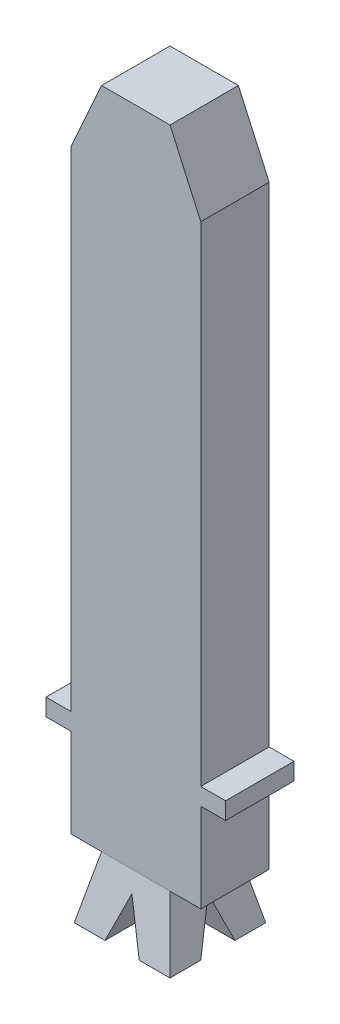
ISO-10303-21;
HEADER;
FILE_DESCRIPTION(('STEP AP214'),'2;1');
FILE_NAME('part.step','',(''),(''),'','','');
FILE_SCHEMA(('AUTOMOTIVE_DESIGN { 1 0 10303 214 1 1 1 1 }'));
ENDSEC;
DATA;
#1=APPLICATION_CONTEXT('core data for automotive mechanical design processes');
#2=APPLICATION_PROTOCOL_DEFINITION('international standard','automotive_design',2000,#1);
#3=PRODUCT_CONTEXT('',#1,'mechanical');
#4=PRODUCT('Part','Part','',(#3));
#5=PRODUCT_RELATED_PRODUCT_CATEGORY('part','',(#4));
#6=PRODUCT_DEFINITION_FORMATION('','',#4);
#7=PRODUCT_DEFINITION_CONTEXT('part definition',#1,'design');
#8=PRODUCT_DEFINITION('design','',#6,#7);
#9=PRODUCT_DEFINITION_SHAPE('','',#8);
#10=(LENGTH_UNIT() NAMED_UNIT(*) SI_UNIT(.MILLI.,.METRE.));
#11=(NAMED_UNIT(*) PLANE_ANGLE_UNIT() SI_UNIT($,.RADIAN.));
#12=(NAMED_UNIT(*) SI_UNIT($,.STERADIAN.) SOLID_ANGLE_UNIT());
#13=UNCERTAINTY_MEASURE_WITH_UNIT(LENGTH_MEASURE(1.E-05),#10,'distance_accuracy_value','');
#14=(GEOMETRIC_REPRESENTATION_CONTEXT(3) GLOBAL_UNCERTAINTY_ASSIGNED_CONTEXT((#13)) GLOBAL_UNIT_ASSIGNED_CONTEXT((#10,
#11,#12)) REPRESENTATION_CONTEXT('',''));
#15=CARTESIAN_POINT('',(0.,0.,0.));
#16=DIRECTION('',(0.,0.,1.));
#17=DIRECTION('',(1.,0.,0.));
#18=AXIS2_PLACEMENT_3D('',#15,#16,#17);
#19=CARTESIAN_POINT('',(0.,-4.9,0.));
#20=DIRECTION('',(0.,-1.,0.));
#21=DIRECTION('',(0.,0.,-1.));
#22=AXIS2_PLACEMENT_3D('',#19,#20,#21);
#23=PLANE('',#22);
#24=DIRECTION('',(-1.,0.,0.));
#25=VECTOR('',#24,1.);
#26=CARTESIAN_POINT('',(2.625,-4.9,1.5));
#27=LINE('',#26,#25);
#28=CARTESIAN_POINT('',(1.4,-4.9,1.5));
#29=VERTEX_POINT('',#28);
#30=CARTESIAN_POINT('',(0.5,-4.9,1.5));
#31=VERTEX_POINT('',#30);
#32=EDGE_CURVE('E478',#29,#31,#27,.T.);
#33=ORIENTED_EDGE('',*,*,#32,.F.);
#34=DIRECTION('',(0.,0.,1.));
#35=VECTOR('',#34,1.);
#36=CARTESIAN_POINT('',(1.4,-4.9,-0.4));
#37=LINE('',#36,#35);
#38=CARTESIAN_POINT('',(1.4,-4.9,2.4));
#39=VERTEX_POINT('',#38);
#40=EDGE_CURVE('E180',#29,#39,#37,.T.);
#41=ORIENTED_EDGE('',*,*,#40,.T.);
#42=DIRECTION('',(-1.,0.,0.));
#43=VECTOR('',#42,1.);
#44=CARTESIAN_POINT('',(1.4,-4.9,2.4));
#45=LINE('',#44,#43);
#46=CARTESIAN_POINT('',(0.500000000000001,-4.9,2.4));
#47=VERTEX_POINT('',#46);
#48=EDGE_CURVE('E355',#39,#47,#45,.T.);
#49=ORIENTED_EDGE('',*,*,#48,.T.);
#50=DIRECTION('',(0.,0.,1.));
#51=VECTOR('',#50,1.);
#52=CARTESIAN_POINT('',(0.500000000000001,-4.9,-0.4001));
#53=LINE('',#52,#51);
#54=EDGE_CURVE('E326',#31,#47,#53,.T.);
#55=ORIENTED_EDGE('',*,*,#54,.F.);
#56=EDGE_LOOP('',(#33,#41,#49,#55));
#57=FACE_BOUND('',#56,.T.);
#58=ADVANCED_FACE('F52',(#57),#23,.T.);
#59=CARTESIAN_POINT('',(-0.499999999999999,-4.9,1.5));
#60=VERTEX_POINT('',#59);
#61=CARTESIAN_POINT('',(-1.4,-4.9,1.5));
#62=VERTEX_POINT('',#61);
#63=EDGE_CURVE('E159',#60,#62,#27,.T.);
#64=ORIENTED_EDGE('',*,*,#63,.F.);
#65=DIRECTION('',(0.,0.,1.));
#66=VECTOR('',#65,1.);
#67=CARTESIAN_POINT('',(-0.499999999999999,-4.9,-0.4001));
#68=LINE('',#67,#66);
#69=CARTESIAN_POINT('',(-0.499999999999999,-4.9,2.4));
#70=VERTEX_POINT('',#69);
#71=EDGE_CURVE('E359',#60,#70,#68,.T.);
#72=ORIENTED_EDGE('',*,*,#71,.T.);
#73=CARTESIAN_POINT('',(-1.4,-4.9,2.4));
#74=VERTEX_POINT('',#73);
#75=EDGE_CURVE('E179',#70,#74,#45,.T.);
#76=ORIENTED_EDGE('',*,*,#75,.T.);
#77=DIRECTION('',(0.,0.,-1.));
#78=VECTOR('',#77,1.);
#79=CARTESIAN_POINT('',(-1.4,-4.9,-0.4));
#80=LINE('',#79,#78);
#81=EDGE_CURVE('E389',#74,#62,#80,.T.);
#82=ORIENTED_EDGE('',*,*,#81,.T.);
#83=EDGE_LOOP('',(#64,#72,#76,#82));
#84=FACE_BOUND('',#83,.T.);
#85=ADVANCED_FACE('F518',(#84),#23,.T.);
#86=CARTESIAN_POINT('',(0.500000000000001,-4.9,-0.4001));
#87=DIRECTION('',(0.932267960991806,0.361768501818747,0.));
#88=DIRECTION('',(-0.361768501818747,0.932267960991806,0.));
#89=AXIS2_PLACEMENT_3D('',#86,#87,#88);
#90=PLANE('',#89);
#91=DIRECTION('',(0.,0.,1.));
#92=VECTOR('',#91,1.);
#93=CARTESIAN_POINT('',(0.,-3.61151308598601,-0.4001));
#94=LINE('',#93,#92);
#95=CARTESIAN_POINT('',(0.,-3.611513085986,0.999999999999999));
#96=VERTEX_POINT('',#95);
#97=CARTESIAN_POINT('',(0.,-3.611513085986,2.11366957466356));
#98=VERTEX_POINT('',#97);
#99=EDGE_CURVE('E472',#96,#98,#94,.T.);
#100=ORIENTED_EDGE('',*,*,#99,.F.);
#101=DIRECTION('',(0.340191275432694,-0.876664013313512,0.340191275432694));
#102=VECTOR('',#101,1.);
#103=CARTESIAN_POINT('',(0.280101229616619,-4.33332662390649,1.28010122961662));
#104=LINE('',#103,#102);
#105=EDGE_CURVE('E171',#96,#31,#104,.T.);
#106=ORIENTED_EDGE('',*,*,#105,.T.);
#107=ORIENTED_EDGE('',*,*,#54,.T.);
#108=DIRECTION('',(0.354246297399246,-0.912883437073675,0.202862986016372));
#109=VECTOR('',#108,1.);
#110=CARTESIAN_POINT('',(-1.3198068575803,-0.210405355949719,1.35786785687772));
#111=LINE('',#110,#109);
#112=EDGE_CURVE('E319',#98,#47,#111,.T.);
#113=ORIENTED_EDGE('',*,*,#112,.F.);
#114=EDGE_LOOP('',(#100,#106,#107,#113));
#115=FACE_BOUND('',#114,.T.);
#116=ADVANCED_FACE('F475',(#115),#90,.F.);
#117=CARTESIAN_POINT('',(0.,-3.61151308598601,-0.4001));
#118=DIRECTION('',(-0.932267960991806,0.361768501818746,0.));
#119=DIRECTION('',(-0.361768501818746,-0.932267960991806,0.));
#120=AXIS2_PLACEMENT_3D('',#117,#118,#119);
#121=PLANE('',#120);
#122=ORIENTED_EDGE('',*,*,#71,.F.);
#123=DIRECTION('',(0.340191275432693,0.876664013313513,-0.340191275432694));
#124=VECTOR('',#123,1.);
#125=CARTESIAN_POINT('',(0.16203371844312,-3.19395643430003,0.837966281556879));
#126=LINE('',#125,#124);
#127=EDGE_CURVE('E13',#60,#96,#126,.T.);
#128=ORIENTED_EDGE('',*,*,#127,.T.);
#129=ORIENTED_EDGE('',*,*,#99,.T.);
#130=DIRECTION('',(0.354246297399245,0.912883437073675,-0.202862986016372));
#131=VECTOR('',#130,1.);
#132=CARTESIAN_POINT('',(1.3198068575803,-0.210405355949717,1.35786785687771));
#133=LINE('',#132,#131);
#134=EDGE_CURVE('E322',#70,#98,#133,.T.);
#135=ORIENTED_EDGE('',*,*,#134,.F.);
#136=EDGE_LOOP('',(#122,#128,#129,#135));
#137=FACE_BOUND('',#136,.T.);
#138=ADVANCED_FACE('F470',(#137),#121,.F.);
#139=DIRECTION('',(-1.,0.,0.));
#140=VECTOR('',#139,1.);
#141=CARTESIAN_POINT('',(2.625,-4.9,0.499999999999999));
#142=LINE('',#141,#140);
#143=CARTESIAN_POINT('',(1.4,-4.9,0.499999999999999));
#144=VERTEX_POINT('',#143);
#145=CARTESIAN_POINT('',(0.5,-4.9,0.499999999999999));
#146=VERTEX_POINT('',#145);
#147=EDGE_CURVE('E148',#144,#146,#142,.T.);
#148=ORIENTED_EDGE('',*,*,#147,.T.);
#149=CARTESIAN_POINT('',(0.500000000000001,-4.9,-0.4));
#150=VERTEX_POINT('',#149);
#151=EDGE_CURVE('E323',#150,#146,#53,.T.);
#152=ORIENTED_EDGE('',*,*,#151,.F.);
#153=DIRECTION('',(1.,0.,0.));
#154=VECTOR('',#153,1.);
#155=CARTESIAN_POINT('',(1.4,-4.9,-0.4));
#156=LINE('',#155,#154);
#157=CARTESIAN_POINT('',(1.4,-4.9,-0.4));
#158=VERTEX_POINT('',#157);
#159=EDGE_CURVE('E177',#150,#158,#156,.T.);
#160=ORIENTED_EDGE('',*,*,#159,.T.);
#161=EDGE_CURVE('E167',#158,#144,#37,.T.);
#162=ORIENTED_EDGE('',*,*,#161,.T.);
#163=EDGE_LOOP('',(#148,#152,#160,#162));
#164=FACE_BOUND('',#163,.T.);
#165=ADVANCED_FACE('F175',(#164),#23,.T.);
#166=CARTESIAN_POINT('',(-0.499999999999999,-4.9,0.499999999999999));
#167=VERTEX_POINT('',#166);
#168=CARTESIAN_POINT('',(-1.4,-4.9,0.499999999999999));
#169=VERTEX_POINT('',#168);
#170=EDGE_CURVE('E71',#167,#169,#142,.T.);
#171=ORIENTED_EDGE('',*,*,#170,.T.);
#172=CARTESIAN_POINT('',(-1.4,-4.9,-0.4));
#173=VERTEX_POINT('',#172);
#174=EDGE_CURVE('E57',#169,#173,#80,.T.);
#175=ORIENTED_EDGE('',*,*,#174,.T.);
#176=CARTESIAN_POINT('',(-0.499999999999999,-4.9,-0.4));
#177=VERTEX_POINT('',#176);
#178=EDGE_CURVE('E249',#173,#177,#156,.T.);
#179=ORIENTED_EDGE('',*,*,#178,.T.);
#180=EDGE_CURVE('E78',#177,#167,#68,.T.);
#181=ORIENTED_EDGE('',*,*,#180,.T.);
#182=EDGE_LOOP('',(#171,#175,#179,#181));
#183=FACE_BOUND('',#182,.T.);
#184=ADVANCED_FACE('F54',(#183),#23,.T.);
#185=CARTESIAN_POINT('',(0.,-3.1,0.));
#186=DIRECTION('',(0.,-1.,0.));
#187=DIRECTION('',(0.,0.,-1.));
#188=AXIS2_PLACEMENT_3D('',#185,#186,#187);
#189=PLANE('',#188);
#190=DIRECTION('',(0.,0.,-1.));
#191=VECTOR('',#190,1.);
#192=CARTESIAN_POINT('',(-1.,-3.1,2.));
#193=LINE('',#192,#191);
#194=CARTESIAN_POINT('',(-1.,-3.1,2.));
#195=VERTEX_POINT('',#194);
#196=CARTESIAN_POINT('',(-1.,-3.1,0.));
#197=VERTEX_POINT('',#196);
#198=EDGE_CURVE('E297',#195,#197,#193,.T.);
#199=ORIENTED_EDGE('',*,*,#198,.F.);
#200=DIRECTION('',(-1.,0.,0.));
#201=VECTOR('',#200,1.);
#202=CARTESIAN_POINT('',(-1.,-3.1,2.));
#203=LINE('',#202,#201);
#204=CARTESIAN_POINT('',(1.,-3.1,2.));
#205=VERTEX_POINT('',#204);
#206=EDGE_CURVE('E302',#205,#195,#203,.T.);
#207=ORIENTED_EDGE('',*,*,#206,.F.);
#208=DIRECTION('',(0.,0.,1.));
#209=VECTOR('',#208,1.);
#210=CARTESIAN_POINT('',(1.,-3.1,2.));
#211=LINE('',#210,#209);
#212=CARTESIAN_POINT('',(1.,-3.1,0.));
#213=VERTEX_POINT('',#212);
#214=EDGE_CURVE('E405',#213,#205,#211,.T.);
#215=ORIENTED_EDGE('',*,*,#214,.F.);
#216=DIRECTION('',(1.,0.,0.));
#217=VECTOR('',#216,1.);
#218=CARTESIAN_POINT('',(-1.,-3.1,0.));
#219=LINE('',#218,#217);
#220=EDGE_CURVE('E437',#197,#213,#219,.T.);
#221=ORIENTED_EDGE('',*,*,#220,.F.);
#222=EDGE_LOOP('',(#199,#207,#215,#221));
#223=FACE_BOUND('',#222,.T.);
#224=ADVANCED_FACE('F415',(#223),#189,.F.);
#225=CARTESIAN_POINT('',(0.,0.277647058823529,1.24941176470588));
#226=DIRECTION('',(0.,-0.216930457818656,-0.976187060183953));
#227=DIRECTION('',(0.,0.976187060183953,-0.216930457818656));
#228=AXIS2_PLACEMENT_3D('',#225,#226,#227);
#229=PLANE('',#228);
#230=ORIENTED_EDGE('',*,*,#134,.T.);
#231=ORIENTED_EDGE('',*,*,#112,.T.);
#232=ORIENTED_EDGE('',*,*,#48,.F.);
#233=DIRECTION('',(0.211999576001272,-0.953998092005724,0.211999576001272));
#234=VECTOR('',#233,1.);
#235=CARTESIAN_POINT('',(1.,-3.1,2.));
#236=LINE('',#235,#234);
#237=EDGE_CURVE('E279',#205,#39,#236,.T.);
#238=ORIENTED_EDGE('',*,*,#237,.F.);
#239=ORIENTED_EDGE('',*,*,#206,.T.);
#240=DIRECTION('',(-0.211999576001272,-0.953998092005724,0.211999576001272));
#241=VECTOR('',#240,1.);
#242=CARTESIAN_POINT('',(-1.,-3.1,2.));
#243=LINE('',#242,#241);
#244=EDGE_CURVE('E283',#195,#74,#243,.T.);
#245=ORIENTED_EDGE('',*,*,#244,.T.);
#246=ORIENTED_EDGE('',*,*,#75,.F.);
#247=EDGE_LOOP('',(#230,#231,#232,#238,#239,#245,#246));
#248=FACE_BOUND('',#247,.T.);
#249=ADVANCED_FACE('F228',(#248),#229,.F.);
#250=CARTESIAN_POINT('',(0.296470588235295,0.0658823529411766,0.));
#251=DIRECTION('',(-0.976187060183953,-0.216930457818656,0.));
#252=DIRECTION('',(0.216930457818656,-0.976187060183953,0.));
#253=AXIS2_PLACEMENT_3D('',#250,#251,#252);
#254=PLANE('',#253);
#255=ORIENTED_EDGE('',*,*,#40,.F.);
#256=DIRECTION('',(-0.202862986016372,0.912883437073675,-0.354246297399246));
#257=VECTOR('',#256,1.);
#258=CARTESIAN_POINT('',(0.32715778629754,-0.0722100383389264,-0.373433835125718));
#259=LINE('',#258,#257);
#260=CARTESIAN_POINT('',(1.11366957466356,-3.611513085986,0.999999999999998));
#261=VERTEX_POINT('',#260);
#262=EDGE_CURVE('E170',#29,#261,#259,.T.);
#263=ORIENTED_EDGE('',*,*,#262,.T.);
#264=DIRECTION('',(0.202862986016372,-0.912883437073675,-0.354246297399245));
#265=VECTOR('',#264,1.);
#266=CARTESIAN_POINT('',(0.470884709648849,-0.718981193419817,2.12245295668356));
#267=LINE('',#266,#265);
#268=EDGE_CURVE('E151',#261,#144,#267,.T.);
#269=ORIENTED_EDGE('',*,*,#268,.T.);
#270=ORIENTED_EDGE('',*,*,#161,.F.);
#271=DIRECTION('',(0.211999576001272,-0.953998092005724,-0.211999576001272));
#272=VECTOR('',#271,1.);
#273=CARTESIAN_POINT('',(1.,-3.1,0.));
#274=LINE('',#273,#272);
#275=EDGE_CURVE('E270',#213,#158,#274,.T.);
#276=ORIENTED_EDGE('',*,*,#275,.F.);
#277=ORIENTED_EDGE('',*,*,#214,.T.);
#278=ORIENTED_EDGE('',*,*,#237,.T.);
#279=EDGE_LOOP('',(#255,#263,#269,#270,#276,#277,#278));
#280=FACE_BOUND('',#279,.T.);
#281=ADVANCED_FACE('F165',(#280),#254,.F.);
#282=CARTESIAN_POINT('',(-0.296470588235294,0.0658823529411765,0.));
#283=DIRECTION('',(0.976187060183953,-0.216930457818656,0.));
#284=DIRECTION('',(0.216930457818656,0.976187060183953,0.));
#285=AXIS2_PLACEMENT_3D('',#282,#283,#284);
#286=PLANE('',#285);
#287=DIRECTION('',(0.202862986016372,0.912883437073675,0.354246297399245));
#288=VECTOR('',#287,1.);
#289=CARTESIAN_POINT('',(-0.470884709648848,-0.718981193419817,2.12245295668357));
#290=LINE('',#289,#288);
#291=CARTESIAN_POINT('',(-1.11366957466356,-3.611513085986,0.999999999999999));
#292=VERTEX_POINT('',#291);
#293=EDGE_CURVE('E172',#169,#292,#290,.T.);
#294=ORIENTED_EDGE('',*,*,#293,.T.);
#295=DIRECTION('',(-0.202862986016372,-0.912883437073675,0.354246297399246));
#296=VECTOR('',#295,1.);
#297=CARTESIAN_POINT('',(-0.327157786297539,-0.0722100383389265,-0.373433835125718));
#298=LINE('',#297,#296);
#299=EDGE_CURVE('E500',#292,#62,#298,.T.);
#300=ORIENTED_EDGE('',*,*,#299,.T.);
#301=ORIENTED_EDGE('',*,*,#81,.F.);
#302=ORIENTED_EDGE('',*,*,#244,.F.);
#303=ORIENTED_EDGE('',*,*,#198,.T.);
#304=DIRECTION('',(-0.211999576001272,-0.953998092005724,-0.211999576001272));
#305=VECTOR('',#304,1.);
#306=CARTESIAN_POINT('',(-1.,-3.1,0.));
#307=LINE('',#306,#305);
#308=EDGE_CURVE('E276',#197,#173,#307,.T.);
#309=ORIENTED_EDGE('',*,*,#308,.T.);
#310=ORIENTED_EDGE('',*,*,#174,.F.);
#311=EDGE_LOOP('',(#294,#300,#301,#302,#303,#309,#310));
#312=FACE_BOUND('',#311,.T.);
#313=ADVANCED_FACE('F227',(#312),#286,.F.);
#314=CARTESIAN_POINT('',(0.,-0.145882352941177,0.656470588235294));
#315=DIRECTION('',(0.,-0.216930457818656,0.976187060183953));
#316=DIRECTION('',(0.,-0.976187060183953,-0.216930457818656));
#317=AXIS2_PLACEMENT_3D('',#314,#315,#316);
#318=PLANE('',#317);
#319=ORIENTED_EDGE('',*,*,#159,.F.);
#320=DIRECTION('',(-0.354246297399246,0.912883437073675,0.202862986016372));
#321=VECTOR('',#320,1.);
#322=CARTESIAN_POINT('',(-1.17607993422899,-0.580785875809028,0.559825360931327));
#323=LINE('',#322,#321);
#324=CARTESIAN_POINT('',(0.,-3.611513085986,-0.113669574663557));
#325=VERTEX_POINT('',#324);
#326=EDGE_CURVE('E361',#150,#325,#323,.T.);
#327=ORIENTED_EDGE('',*,*,#326,.T.);
#328=DIRECTION('',(-0.354246297399245,-0.912883437073675,-0.202862986016372));
#329=VECTOR('',#328,1.);
#330=CARTESIAN_POINT('',(1.17607993422899,-0.580785875809026,0.559825360931328));
#331=LINE('',#330,#329);
#332=EDGE_CURVE('E364',#325,#177,#331,.T.);
#333=ORIENTED_EDGE('',*,*,#332,.T.);
#334=ORIENTED_EDGE('',*,*,#178,.F.);
#335=ORIENTED_EDGE('',*,*,#308,.F.);
#336=ORIENTED_EDGE('',*,*,#220,.T.);
#337=ORIENTED_EDGE('',*,*,#275,.T.);
#338=EDGE_LOOP('',(#319,#327,#333,#334,#335,#336,#337));
#339=FACE_BOUND('',#338,.T.);
#340=ADVANCED_FACE('F253',(#339),#318,.F.);
#341=ORIENTED_EDGE('',*,*,#151,.T.);
#342=DIRECTION('',(-0.340191275432694,0.876664013313513,0.340191275432693));
#343=VECTOR('',#342,1.);
#344=CARTESIAN_POINT('',(0.604168666502859,-5.16843992727844,0.395831333497141));
#345=LINE('',#344,#343);
#346=EDGE_CURVE('E154',#146,#96,#345,.T.);
#347=ORIENTED_EDGE('',*,*,#346,.T.);
#348=EDGE_CURVE('E360',#325,#96,#94,.T.);
#349=ORIENTED_EDGE('',*,*,#348,.F.);
#350=ORIENTED_EDGE('',*,*,#326,.F.);
#351=EDGE_LOOP('',(#341,#347,#349,#350));
#352=FACE_BOUND('',#351,.T.);
#353=ADVANCED_FACE('F261',(#352),#90,.F.);
#354=ORIENTED_EDGE('',*,*,#348,.T.);
#355=DIRECTION('',(-0.340191275432693,-0.876664013313513,-0.340191275432693));
#356=VECTOR('',#355,1.);
#357=CARTESIAN_POINT('',(-0.16203371844312,-4.02906973767198,0.837966281556879));
#358=LINE('',#357,#356);
#359=EDGE_CURVE('E63',#96,#167,#358,.T.);
#360=ORIENTED_EDGE('',*,*,#359,.T.);
#361=ORIENTED_EDGE('',*,*,#180,.F.);
#362=ORIENTED_EDGE('',*,*,#332,.F.);
#363=EDGE_LOOP('',(#354,#360,#361,#362));
#364=FACE_BOUND('',#363,.T.);
#365=ADVANCED_FACE('F529',(#364),#121,.F.);
#366=CARTESIAN_POINT('',(2.625,-3.611513085986,0.999999999999999));
#367=DIRECTION('',(0.,0.361768501818746,-0.932267960991806));
#368=DIRECTION('',(0.,0.932267960991806,0.361768501818746));
#369=AXIS2_PLACEMENT_3D('',#366,#367,#368);
#370=PLANE('',#369);
#371=ORIENTED_EDGE('',*,*,#170,.F.);
#372=ORIENTED_EDGE('',*,*,#359,.F.);
#373=DIRECTION('',(-1.,0.,0.));
#374=VECTOR('',#373,1.);
#375=CARTESIAN_POINT('',(2.625,-3.611513085986,0.999999999999999));
#376=LINE('',#375,#374);
#377=EDGE_CURVE('E492',#96,#292,#376,.T.);
#378=ORIENTED_EDGE('',*,*,#377,.T.);
#379=ORIENTED_EDGE('',*,*,#293,.F.);
#380=EDGE_LOOP('',(#371,#372,#378,#379));
#381=FACE_BOUND('',#380,.T.);
#382=ADVANCED_FACE('F502',(#381),#370,.F.);
#383=CARTESIAN_POINT('',(2.625,-4.9,1.5));
#384=DIRECTION('',(0.,0.361768501818747,0.932267960991806));
#385=DIRECTION('',(0.,-0.932267960991806,0.361768501818747));
#386=AXIS2_PLACEMENT_3D('',#383,#384,#385);
#387=PLANE('',#386);
#388=ORIENTED_EDGE('',*,*,#377,.F.);
#389=ORIENTED_EDGE('',*,*,#127,.F.);
#390=ORIENTED_EDGE('',*,*,#63,.T.);
#391=ORIENTED_EDGE('',*,*,#299,.F.);
#392=EDGE_LOOP('',(#388,#389,#390,#391));
#393=FACE_BOUND('',#392,.T.);
#394=ADVANCED_FACE('F510',(#393),#387,.F.);
#395=ORIENTED_EDGE('',*,*,#32,.T.);
#396=ORIENTED_EDGE('',*,*,#105,.F.);
#397=EDGE_CURVE('E495',#261,#96,#376,.T.);
#398=ORIENTED_EDGE('',*,*,#397,.F.);
#399=ORIENTED_EDGE('',*,*,#262,.F.);
#400=EDGE_LOOP('',(#395,#396,#398,#399));
#401=FACE_BOUND('',#400,.T.);
#402=ADVANCED_FACE('F505',(#401),#387,.F.);
#403=ORIENTED_EDGE('',*,*,#397,.T.);
#404=ORIENTED_EDGE('',*,*,#346,.F.);
#405=ORIENTED_EDGE('',*,*,#147,.F.);
#406=ORIENTED_EDGE('',*,*,#268,.F.);
#407=EDGE_LOOP('',(#403,#404,#405,#406));
#408=FACE_BOUND('',#407,.T.);
#409=ADVANCED_FACE('F150',(#408),#370,.F.);
#410=CLOSED_SHELL('',(#58,#85,#116,#138,#165,#184,#224,#249,#281,#313,#340,#353,#365,#382,#394,
#402,#409));
#411=MANIFOLD_SOLID_BREP('B2',#410);
#412=CARTESIAN_POINT('',(-1.9,14.3,2.));
#413=DIRECTION('',(0.911921505175107,-0.410364677328798,0.));
#414=DIRECTION('',(0.410364677328798,0.911921505175107,0.));
#415=AXIS2_PLACEMENT_3D('',#412,#413,#414);
#416=PLANE('',#415);
#417=DIRECTION('',(-0.410364677328797,-0.911921505175106,0.));
#418=VECTOR('',#417,1.);
#419=CARTESIAN_POINT('',(-1.9,14.3,0.));
#420=LINE('',#419,#418);
#421=CARTESIAN_POINT('',(-1.,16.3,0.));
#422=VERTEX_POINT('',#421);
#423=CARTESIAN_POINT('',(-1.9,14.3,0.));
#424=VERTEX_POINT('',#423);
#425=EDGE_CURVE('E802',#422,#424,#420,.T.);
#426=ORIENTED_EDGE('',*,*,#425,.T.);
#427=DIRECTION('',(0.,0.,-1.));
#428=VECTOR('',#427,1.);
#429=CARTESIAN_POINT('',(-1.9,14.3,2.));
#430=LINE('',#429,#428);
#431=CARTESIAN_POINT('',(-1.9,14.3,2.));
#432=VERTEX_POINT('',#431);
#433=EDGE_CURVE('E50',#432,#424,#430,.T.);
#434=ORIENTED_EDGE('',*,*,#433,.F.);
#435=DIRECTION('',(-0.410364677328797,-0.911921505175106,0.));
#436=VECTOR('',#435,1.);
#437=CARTESIAN_POINT('',(-1.9,14.3,2.));
#438=LINE('',#437,#436);
#439=CARTESIAN_POINT('',(-1.,16.3,2.));
#440=VERTEX_POINT('',#439);
#441=EDGE_CURVE('E828',#440,#432,#438,.T.);
#442=ORIENTED_EDGE('',*,*,#441,.F.);
#443=DIRECTION('',(0.,0.,-1.));
#444=VECTOR('',#443,1.);
#445=CARTESIAN_POINT('',(-1.,16.3,2.));
#446=LINE('',#445,#444);
#447=EDGE_CURVE('E798',#440,#422,#446,.T.);
#448=ORIENTED_EDGE('',*,*,#447,.T.);
#449=EDGE_LOOP('',(#426,#434,#442,#448));
#450=FACE_BOUND('',#449,.T.);
#451=ADVANCED_FACE('F670',(#450),#416,.F.);
#452=CARTESIAN_POINT('',(-1.9,14.3,2.));
#453=DIRECTION('',(1.,0.,0.));
#454=DIRECTION('',(0.,1.,0.));
#455=AXIS2_PLACEMENT_3D('',#452,#453,#454);
#456=PLANE('',#455);
#457=DIRECTION('',(0.,-1.,0.));
#458=VECTOR('',#457,1.);
#459=CARTESIAN_POINT('',(-1.9,14.3,0.));
#460=LINE('',#459,#458);
#461=CARTESIAN_POINT('',(-1.9,0.,0.));
#462=VERTEX_POINT('',#461);
#463=EDGE_CURVE('E805',#424,#462,#460,.T.);
#464=ORIENTED_EDGE('',*,*,#463,.T.);
#465=DIRECTION('',(0.,0.,-1.));
#466=VECTOR('',#465,1.);
#467=CARTESIAN_POINT('',(-1.9,0.,2.));
#468=LINE('',#467,#466);
#469=CARTESIAN_POINT('',(-1.9,0.,2.));
#470=VERTEX_POINT('',#469);
#471=EDGE_CURVE('E678',#470,#462,#468,.T.);
#472=ORIENTED_EDGE('',*,*,#471,.F.);
#473=DIRECTION('',(0.,-1.,0.));
#474=VECTOR('',#473,1.);
#475=CARTESIAN_POINT('',(-1.9,14.3,2.));
#476=LINE('',#475,#474);
#477=EDGE_CURVE('E747',#432,#470,#476,.T.);
#478=ORIENTED_EDGE('',*,*,#477,.F.);
#479=ORIENTED_EDGE('',*,*,#433,.T.);
#480=EDGE_LOOP('',(#464,#472,#478,#479));
#481=FACE_BOUND('',#480,.T.);
#482=ADVANCED_FACE('F916',(#481),#456,.F.);
#483=CARTESIAN_POINT('',(-2.625,0.,2.));
#484=DIRECTION('',(0.,-1.,0.));
#485=DIRECTION('',(1.,0.,0.));
#486=AXIS2_PLACEMENT_3D('',#483,#484,#485);
#487=PLANE('',#486);
#488=DIRECTION('',(-1.,0.,0.));
#489=VECTOR('',#488,1.);
#490=CARTESIAN_POINT('',(-2.625,0.,0.));
#491=LINE('',#490,#489);
#492=CARTESIAN_POINT('',(-2.625,0.,0.));
#493=VERTEX_POINT('',#492);
#494=EDGE_CURVE('E807',#462,#493,#491,.T.);
#495=ORIENTED_EDGE('',*,*,#494,.T.);
#496=DIRECTION('',(0.,0.,-1.));
#497=VECTOR('',#496,1.);
#498=CARTESIAN_POINT('',(-2.625,0.,2.));
#499=LINE('',#498,#497);
#500=CARTESIAN_POINT('',(-2.625,0.,2.));
#501=VERTEX_POINT('',#500);
#502=EDGE_CURVE('E853',#501,#493,#499,.T.);
#503=ORIENTED_EDGE('',*,*,#502,.F.);
#504=DIRECTION('',(-1.,0.,0.));
#505=VECTOR('',#504,1.);
#506=CARTESIAN_POINT('',(-2.625,0.,2.));
#507=LINE('',#506,#505);
#508=EDGE_CURVE('E861',#470,#501,#507,.T.);
#509=ORIENTED_EDGE('',*,*,#508,.F.);
#510=ORIENTED_EDGE('',*,*,#471,.T.);
#511=EDGE_LOOP('',(#495,#503,#509,#510));
#512=FACE_BOUND('',#511,.T.);
#513=ADVANCED_FACE('F859',(#512),#487,.F.);
#514=CARTESIAN_POINT('',(-2.625,0.,2.));
#515=DIRECTION('',(1.,0.,0.));
#516=DIRECTION('',(0.,0.,-1.));
#517=AXIS2_PLACEMENT_3D('',#514,#515,#516);
#518=PLANE('',#517);
#519=DIRECTION('',(0.,-1.,0.));
#520=VECTOR('',#519,1.);
#521=CARTESIAN_POINT('',(-2.625,0.,0.));
#522=LINE('',#521,#520);
#523=CARTESIAN_POINT('',(-2.625,-0.5,0.));
#524=VERTEX_POINT('',#523);
#525=EDGE_CURVE('E809',#493,#524,#522,.T.);
#526=ORIENTED_EDGE('',*,*,#525,.T.);
#527=DIRECTION('',(0.,0.,-1.));
#528=VECTOR('',#527,1.);
#529=CARTESIAN_POINT('',(-2.625,-0.5,2.));
#530=LINE('',#529,#528);
#531=CARTESIAN_POINT('',(-2.625,-0.5,2.));
#532=VERTEX_POINT('',#531);
#533=EDGE_CURVE('E850',#532,#524,#530,.T.);
#534=ORIENTED_EDGE('',*,*,#533,.F.);
#535=DIRECTION('',(0.,-1.,0.));
#536=VECTOR('',#535,1.);
#537=CARTESIAN_POINT('',(-2.625,0.,2.));
#538=LINE('',#537,#536);
#539=EDGE_CURVE('E879',#501,#532,#538,.T.);
#540=ORIENTED_EDGE('',*,*,#539,.F.);
#541=ORIENTED_EDGE('',*,*,#502,.T.);
#542=EDGE_LOOP('',(#526,#534,#540,#541));
#543=FACE_BOUND('',#542,.T.);
#544=ADVANCED_FACE('F870',(#543),#518,.F.);
#545=CARTESIAN_POINT('',(-2.625,-0.5,2.));
#546=DIRECTION('',(0.,1.,0.));
#547=DIRECTION('',(0.,0.,1.));
#548=AXIS2_PLACEMENT_3D('',#545,#546,#547);
#549=PLANE('',#548);
#550=DIRECTION('',(1.,0.,0.));
#551=VECTOR('',#550,1.);
#552=CARTESIAN_POINT('',(-2.625,-0.5,0.));
#553=LINE('',#552,#551);
#554=CARTESIAN_POINT('',(-1.9,-0.5,0.));
#555=VERTEX_POINT('',#554);
#556=EDGE_CURVE('E811',#524,#555,#553,.T.);
#557=ORIENTED_EDGE('',*,*,#556,.T.);
#558=DIRECTION('',(0.,0.,-1.));
#559=VECTOR('',#558,1.);
#560=CARTESIAN_POINT('',(-1.9,-0.5,2.));
#561=LINE('',#560,#559);
#562=CARTESIAN_POINT('',(-1.9,-0.5,2.));
#563=VERTEX_POINT('',#562);
#564=EDGE_CURVE('E847',#563,#555,#561,.T.);
#565=ORIENTED_EDGE('',*,*,#564,.F.);
#566=DIRECTION('',(1.,0.,0.));
#567=VECTOR('',#566,1.);
#568=CARTESIAN_POINT('',(-2.625,-0.5,2.));
#569=LINE('',#568,#567);
#570=EDGE_CURVE('E876',#532,#563,#569,.T.);
#571=ORIENTED_EDGE('',*,*,#570,.F.);
#572=ORIENTED_EDGE('',*,*,#533,.T.);
#573=EDGE_LOOP('',(#557,#565,#571,#572));
#574=FACE_BOUND('',#573,.T.);
#575=ADVANCED_FACE('F874',(#574),#549,.F.);
#576=CARTESIAN_POINT('',(-1.9,-0.5,2.));
#577=DIRECTION('',(1.,0.,0.));
#578=DIRECTION('',(0.,1.,0.));
#579=AXIS2_PLACEMENT_3D('',#576,#577,#578);
#580=PLANE('',#579);
#581=DIRECTION('',(0.,-1.,0.));
#582=VECTOR('',#581,1.);
#583=CARTESIAN_POINT('',(-1.9,-0.5,0.));
#584=LINE('',#583,#582);
#585=CARTESIAN_POINT('',(-1.9,-3.1,0.));
#586=VERTEX_POINT('',#585);
#587=EDGE_CURVE('E813',#555,#586,#584,.T.);
#588=ORIENTED_EDGE('',*,*,#587,.T.);
#589=DIRECTION('',(0.,0.,-1.));
#590=VECTOR('',#589,1.);
#591=CARTESIAN_POINT('',(-1.9,-3.1,2.));
#592=LINE('',#591,#590);
#593=CARTESIAN_POINT('',(-1.9,-3.1,2.));
#594=VERTEX_POINT('',#593);
#595=EDGE_CURVE('E844',#594,#586,#592,.T.);
#596=ORIENTED_EDGE('',*,*,#595,.F.);
#597=DIRECTION('',(0.,-1.,0.));
#598=VECTOR('',#597,1.);
#599=CARTESIAN_POINT('',(-1.9,-0.5,2.));
#600=LINE('',#599,#598);
#601=EDGE_CURVE('E878',#563,#594,#600,.T.);
#602=ORIENTED_EDGE('',*,*,#601,.F.);
#603=ORIENTED_EDGE('',*,*,#564,.T.);
#604=EDGE_LOOP('',(#588,#596,#602,#603));
#605=FACE_BOUND('',#604,.T.);
#606=ADVANCED_FACE('F929',(#605),#580,.F.);
#607=CARTESIAN_POINT('',(-1.9,-3.1,2.));
#608=DIRECTION('',(0.,1.,0.));
#609=DIRECTION('',(0.,0.,1.));
#610=AXIS2_PLACEMENT_3D('',#607,#608,#609);
#611=PLANE('',#610);
#612=DIRECTION('',(1.,0.,0.));
#613=VECTOR('',#612,1.);
#614=CARTESIAN_POINT('',(-1.9,-3.1,0.));
#615=LINE('',#614,#613);
#616=CARTESIAN_POINT('',(1.9,-3.1,0.));
#617=VERTEX_POINT('',#616);
#618=EDGE_CURVE('E815',#586,#617,#615,.T.);
#619=ORIENTED_EDGE('',*,*,#618,.T.);
#620=DIRECTION('',(0.,0.,-1.));
#621=VECTOR('',#620,1.);
#622=CARTESIAN_POINT('',(1.9,-3.1,2.));
#623=LINE('',#622,#621);
#624=CARTESIAN_POINT('',(1.9,-3.1,2.));
#625=VERTEX_POINT('',#624);
#626=EDGE_CURVE('E841',#625,#617,#623,.T.);
#627=ORIENTED_EDGE('',*,*,#626,.F.);
#628=DIRECTION('',(1.,0.,0.));
#629=VECTOR('',#628,1.);
#630=CARTESIAN_POINT('',(-1.9,-3.1,2.));
#631=LINE('',#630,#629);
#632=EDGE_CURVE('E881',#594,#625,#631,.T.);
#633=ORIENTED_EDGE('',*,*,#632,.F.);
#634=ORIENTED_EDGE('',*,*,#595,.T.);
#635=EDGE_LOOP('',(#619,#627,#633,#634));
#636=FACE_BOUND('',#635,.T.);
#637=ADVANCED_FACE('F932',(#636),#611,.F.);
#638=CARTESIAN_POINT('',(1.9,-0.5,2.));
#639=DIRECTION('',(-1.,0.,0.));
#640=DIRECTION('',(0.,-1.,0.));
#641=AXIS2_PLACEMENT_3D('',#638,#639,#640);
#642=PLANE('',#641);
#643=DIRECTION('',(0.,1.,0.));
#644=VECTOR('',#643,1.);
#645=CARTESIAN_POINT('',(1.9,-0.5,0.));
#646=LINE('',#645,#644);
#647=CARTESIAN_POINT('',(1.9,-0.5,0.));
#648=VERTEX_POINT('',#647);
#649=EDGE_CURVE('E817',#617,#648,#646,.T.);
#650=ORIENTED_EDGE('',*,*,#649,.T.);
#651=DIRECTION('',(0.,0.,-1.));
#652=VECTOR('',#651,1.);
#653=CARTESIAN_POINT('',(1.9,-0.5,2.));
#654=LINE('',#653,#652);
#655=CARTESIAN_POINT('',(1.9,-0.5,2.));
#656=VERTEX_POINT('',#655);
#657=EDGE_CURVE('E838',#656,#648,#654,.T.);
#658=ORIENTED_EDGE('',*,*,#657,.F.);
#659=DIRECTION('',(0.,1.,0.));
#660=VECTOR('',#659,1.);
#661=CARTESIAN_POINT('',(1.9,-0.5,2.));
#662=LINE('',#661,#660);
#663=EDGE_CURVE('E887',#625,#656,#662,.T.);
#664=ORIENTED_EDGE('',*,*,#663,.F.);
#665=ORIENTED_EDGE('',*,*,#626,.T.);
#666=EDGE_LOOP('',(#650,#658,#664,#665));
#667=FACE_BOUND('',#666,.T.);
#668=ADVANCED_FACE('F936',(#667),#642,.F.);
#669=CARTESIAN_POINT('',(1.9,-0.5,2.));
#670=DIRECTION('',(0.,1.,0.));
#671=DIRECTION('',(0.,0.,1.));
#672=AXIS2_PLACEMENT_3D('',#669,#670,#671);
#673=PLANE('',#672);
#674=DIRECTION('',(1.,0.,0.));
#675=VECTOR('',#674,1.);
#676=CARTESIAN_POINT('',(1.9,-0.5,0.));
#677=LINE('',#676,#675);
#678=CARTESIAN_POINT('',(2.625,-0.5,0.));
#679=VERTEX_POINT('',#678);
#680=EDGE_CURVE('E819',#648,#679,#677,.T.);
#681=ORIENTED_EDGE('',*,*,#680,.T.);
#682=DIRECTION('',(0.,0.,-1.));
#683=VECTOR('',#682,1.);
#684=CARTESIAN_POINT('',(2.625,-0.5,2.));
#685=LINE('',#684,#683);
#686=CARTESIAN_POINT('',(2.625,-0.5,2.));
#687=VERTEX_POINT('',#686);
#688=EDGE_CURVE('E835',#687,#679,#685,.T.);
#689=ORIENTED_EDGE('',*,*,#688,.F.);
#690=DIRECTION('',(1.,0.,0.));
#691=VECTOR('',#690,1.);
#692=CARTESIAN_POINT('',(1.9,-0.5,2.));
#693=LINE('',#692,#691);
#694=EDGE_CURVE('E889',#656,#687,#693,.T.);
#695=ORIENTED_EDGE('',*,*,#694,.F.);
#696=ORIENTED_EDGE('',*,*,#657,.T.);
#697=EDGE_LOOP('',(#681,#689,#695,#696));
#698=FACE_BOUND('',#697,.T.);
#699=ADVANCED_FACE('F940',(#698),#673,.F.);
#700=CARTESIAN_POINT('',(2.625,0.,2.));
#701=DIRECTION('',(-1.,0.,0.));
#702=DIRECTION('',(0.,0.,1.));
#703=AXIS2_PLACEMENT_3D('',#700,#701,#702);
#704=PLANE('',#703);
#705=DIRECTION('',(0.,1.,0.));
#706=VECTOR('',#705,1.);
#707=CARTESIAN_POINT('',(2.625,0.,0.));
#708=LINE('',#707,#706);
#709=CARTESIAN_POINT('',(2.625,0.,0.));
#710=VERTEX_POINT('',#709);
#711=EDGE_CURVE('E821',#679,#710,#708,.T.);
#712=ORIENTED_EDGE('',*,*,#711,.T.);
#713=DIRECTION('',(0.,0.,-1.));
#714=VECTOR('',#713,1.);
#715=CARTESIAN_POINT('',(2.625,0.,2.));
#716=LINE('',#715,#714);
#717=CARTESIAN_POINT('',(2.625,0.,2.));
#718=VERTEX_POINT('',#717);
#719=EDGE_CURVE('E832',#718,#710,#716,.T.);
#720=ORIENTED_EDGE('',*,*,#719,.F.);
#721=DIRECTION('',(0.,1.,0.));
#722=VECTOR('',#721,1.);
#723=CARTESIAN_POINT('',(2.625,0.,2.));
#724=LINE('',#723,#722);
#725=EDGE_CURVE('E891',#687,#718,#724,.T.);
#726=ORIENTED_EDGE('',*,*,#725,.F.);
#727=ORIENTED_EDGE('',*,*,#688,.T.);
#728=EDGE_LOOP('',(#712,#720,#726,#727));
#729=FACE_BOUND('',#728,.T.);
#730=ADVANCED_FACE('F897',(#729),#704,.F.);
#731=CARTESIAN_POINT('',(1.9,0.,2.));
#732=DIRECTION('',(0.,-1.,0.));
#733=DIRECTION('',(1.,0.,0.));
#734=AXIS2_PLACEMENT_3D('',#731,#732,#733);
#735=PLANE('',#734);
#736=DIRECTION('',(-1.,0.,0.));
#737=VECTOR('',#736,1.);
#738=CARTESIAN_POINT('',(1.9,0.,0.));
#739=LINE('',#738,#737);
#740=CARTESIAN_POINT('',(1.9,0.,0.));
#741=VERTEX_POINT('',#740);
#742=EDGE_CURVE('E823',#710,#741,#739,.T.);
#743=ORIENTED_EDGE('',*,*,#742,.T.);
#744=DIRECTION('',(0.,0.,-1.));
#745=VECTOR('',#744,1.);
#746=CARTESIAN_POINT('',(1.9,0.,2.));
#747=LINE('',#746,#745);
#748=CARTESIAN_POINT('',(1.9,0.,2.));
#749=VERTEX_POINT('',#748);
#750=EDGE_CURVE('E793',#749,#741,#747,.T.);
#751=ORIENTED_EDGE('',*,*,#750,.F.);
#752=DIRECTION('',(-1.,0.,0.));
#753=VECTOR('',#752,1.);
#754=CARTESIAN_POINT('',(1.9,0.,2.));
#755=LINE('',#754,#753);
#756=EDGE_CURVE('E784',#718,#749,#755,.T.);
#757=ORIENTED_EDGE('',*,*,#756,.F.);
#758=ORIENTED_EDGE('',*,*,#719,.T.);
#759=EDGE_LOOP('',(#743,#751,#757,#758));
#760=FACE_BOUND('',#759,.T.);
#761=ADVANCED_FACE('F901',(#760),#735,.F.);
#762=CARTESIAN_POINT('',(1.9,14.3,2.));
#763=DIRECTION('',(-1.,0.,0.));
#764=DIRECTION('',(0.,-1.,0.));
#765=AXIS2_PLACEMENT_3D('',#762,#763,#764);
#766=PLANE('',#765);
#767=DIRECTION('',(0.,1.,0.));
#768=VECTOR('',#767,1.);
#769=CARTESIAN_POINT('',(1.9,14.3,0.));
#770=LINE('',#769,#768);
#771=CARTESIAN_POINT('',(1.9,14.3,0.));
#772=VERTEX_POINT('',#771);
#773=EDGE_CURVE('E792',#741,#772,#770,.T.);
#774=ORIENTED_EDGE('',*,*,#773,.T.);
#775=DIRECTION('',(0.,0.,-1.));
#776=VECTOR('',#775,1.);
#777=CARTESIAN_POINT('',(1.9,14.3,2.));
#778=LINE('',#777,#776);
#779=CARTESIAN_POINT('',(1.9,14.3,2.));
#780=VERTEX_POINT('',#779);
#781=EDGE_CURVE('E789',#780,#772,#778,.T.);
#782=ORIENTED_EDGE('',*,*,#781,.F.);
#783=DIRECTION('',(0.,1.,0.));
#784=VECTOR('',#783,1.);
#785=CARTESIAN_POINT('',(1.9,14.3,2.));
#786=LINE('',#785,#784);
#787=EDGE_CURVE('E778',#749,#780,#786,.T.);
#788=ORIENTED_EDGE('',*,*,#787,.F.);
#789=ORIENTED_EDGE('',*,*,#750,.T.);
#790=EDGE_LOOP('',(#774,#782,#788,#789));
#791=FACE_BOUND('',#790,.T.);
#792=ADVANCED_FACE('F790',(#791),#766,.F.);
#793=CARTESIAN_POINT('',(0.999999999999998,16.3,2.));
#794=DIRECTION('',(-0.911921505175107,-0.410364677328798,0.));
#795=DIRECTION('',(0.410364677328798,-0.911921505175107,0.));
#796=AXIS2_PLACEMENT_3D('',#793,#794,#795);
#797=PLANE('',#796);
#798=DIRECTION('',(-0.410364677328797,0.911921505175106,0.));
#799=VECTOR('',#798,1.);
#800=CARTESIAN_POINT('',(0.999999999999998,16.3,0.));
#801=LINE('',#800,#799);
#802=CARTESIAN_POINT('',(0.999999999999998,16.3,0.));
#803=VERTEX_POINT('',#802);
#804=EDGE_CURVE('E733',#772,#803,#801,.T.);
#805=ORIENTED_EDGE('',*,*,#804,.T.);
#806=DIRECTION('',(0.,0.,-1.));
#807=VECTOR('',#806,1.);
#808=CARTESIAN_POINT('',(0.999999999999998,16.3,2.));
#809=LINE('',#808,#807);
#810=CARTESIAN_POINT('',(0.999999999999998,16.3,2.));
#811=VERTEX_POINT('',#810);
#812=EDGE_CURVE('E794',#811,#803,#809,.T.);
#813=ORIENTED_EDGE('',*,*,#812,.F.);
#814=DIRECTION('',(-0.410364677328797,0.911921505175106,0.));
#815=VECTOR('',#814,1.);
#816=CARTESIAN_POINT('',(0.999999999999998,16.3,2.));
#817=LINE('',#816,#815);
#818=EDGE_CURVE('E782',#780,#811,#817,.T.);
#819=ORIENTED_EDGE('',*,*,#818,.F.);
#820=ORIENTED_EDGE('',*,*,#781,.T.);
#821=EDGE_LOOP('',(#805,#813,#819,#820));
#822=FACE_BOUND('',#821,.T.);
#823=ADVANCED_FACE('F796',(#822),#797,.F.);
#824=CARTESIAN_POINT('',(-1.,16.3,2.));
#825=DIRECTION('',(0.,-1.,0.));
#826=DIRECTION('',(0.,0.,-1.));
#827=AXIS2_PLACEMENT_3D('',#824,#825,#826);
#828=PLANE('',#827);
#829=DIRECTION('',(-1.,0.,0.));
#830=VECTOR('',#829,1.);
#831=CARTESIAN_POINT('',(-1.,16.3,0.));
#832=LINE('',#831,#830);
#833=EDGE_CURVE('E739',#803,#422,#832,.T.);
#834=ORIENTED_EDGE('',*,*,#833,.T.);
#835=ORIENTED_EDGE('',*,*,#447,.F.);
#836=DIRECTION('',(-1.,0.,0.));
#837=VECTOR('',#836,1.);
#838=CARTESIAN_POINT('',(-1.,16.3,2.));
#839=LINE('',#838,#837);
#840=EDGE_CURVE('E686',#811,#440,#839,.T.);
#841=ORIENTED_EDGE('',*,*,#840,.F.);
#842=ORIENTED_EDGE('',*,*,#812,.T.);
#843=EDGE_LOOP('',(#834,#835,#841,#842));
#844=FACE_BOUND('',#843,.T.);
#845=ADVANCED_FACE('F905',(#844),#828,.F.);
#846=CARTESIAN_POINT('',(0.,0.,2.));
#847=DIRECTION('',(0.,0.,-1.));
#848=DIRECTION('',(-1.,0.,0.));
#849=AXIS2_PLACEMENT_3D('',#846,#847,#848);
#850=PLANE('',#849);
#851=ORIENTED_EDGE('',*,*,#441,.T.);
#852=ORIENTED_EDGE('',*,*,#477,.T.);
#853=ORIENTED_EDGE('',*,*,#508,.T.);
#854=ORIENTED_EDGE('',*,*,#539,.T.);
#855=ORIENTED_EDGE('',*,*,#570,.T.);
#856=ORIENTED_EDGE('',*,*,#601,.T.);
#857=ORIENTED_EDGE('',*,*,#632,.T.);
#858=ORIENTED_EDGE('',*,*,#663,.T.);
#859=ORIENTED_EDGE('',*,*,#694,.T.);
#860=ORIENTED_EDGE('',*,*,#725,.T.);
#861=ORIENTED_EDGE('',*,*,#756,.T.);
#862=ORIENTED_EDGE('',*,*,#787,.T.);
#863=ORIENTED_EDGE('',*,*,#818,.T.);
#864=ORIENTED_EDGE('',*,*,#840,.T.);
#865=EDGE_LOOP('',(#851,#852,#853,#854,#855,#856,#857,#858,#859,#860,#861,#862,#863,#864));
#866=FACE_BOUND('',#865,.T.);
#867=ADVANCED_FACE('F780',(#866),#850,.F.);
#868=CARTESIAN_POINT('',(0.,0.,0.));
#869=DIRECTION('',(0.,0.,-1.));
#870=DIRECTION('',(-1.,0.,0.));
#871=AXIS2_PLACEMENT_3D('',#868,#869,#870);
#872=PLANE('',#871);
#873=ORIENTED_EDGE('',*,*,#425,.F.);
#874=ORIENTED_EDGE('',*,*,#833,.F.);
#875=ORIENTED_EDGE('',*,*,#804,.F.);
#876=ORIENTED_EDGE('',*,*,#773,.F.);
#877=ORIENTED_EDGE('',*,*,#742,.F.);
#878=ORIENTED_EDGE('',*,*,#711,.F.);
#879=ORIENTED_EDGE('',*,*,#680,.F.);
#880=ORIENTED_EDGE('',*,*,#649,.F.);
#881=ORIENTED_EDGE('',*,*,#618,.F.);
#882=ORIENTED_EDGE('',*,*,#587,.F.);
#883=ORIENTED_EDGE('',*,*,#556,.F.);
#884=ORIENTED_EDGE('',*,*,#525,.F.);
#885=ORIENTED_EDGE('',*,*,#494,.F.);
#886=ORIENTED_EDGE('',*,*,#463,.F.);
#887=EDGE_LOOP('',(#873,#874,#875,#876,#877,#878,#879,#880,#881,#882,#883,#884,#885,#886));
#888=FACE_BOUND('',#887,.T.);
#889=ADVANCED_FACE('F865',(#888),#872,.T.);
#890=CLOSED_SHELL('',(#451,#482,#513,#544,#575,#606,#637,#668,#699,#730,#761,#792,#823,#845,
#867,#889));
#891=MANIFOLD_SOLID_BREP('B7',#890);
#892=ADVANCED_BREP_SHAPE_REPRESENTATION('',(#18,#411,#891),#14);
#893=SHAPE_DEFINITION_REPRESENTATION(#9,#892);
ENDSEC;
END-ISO-10303-21;
